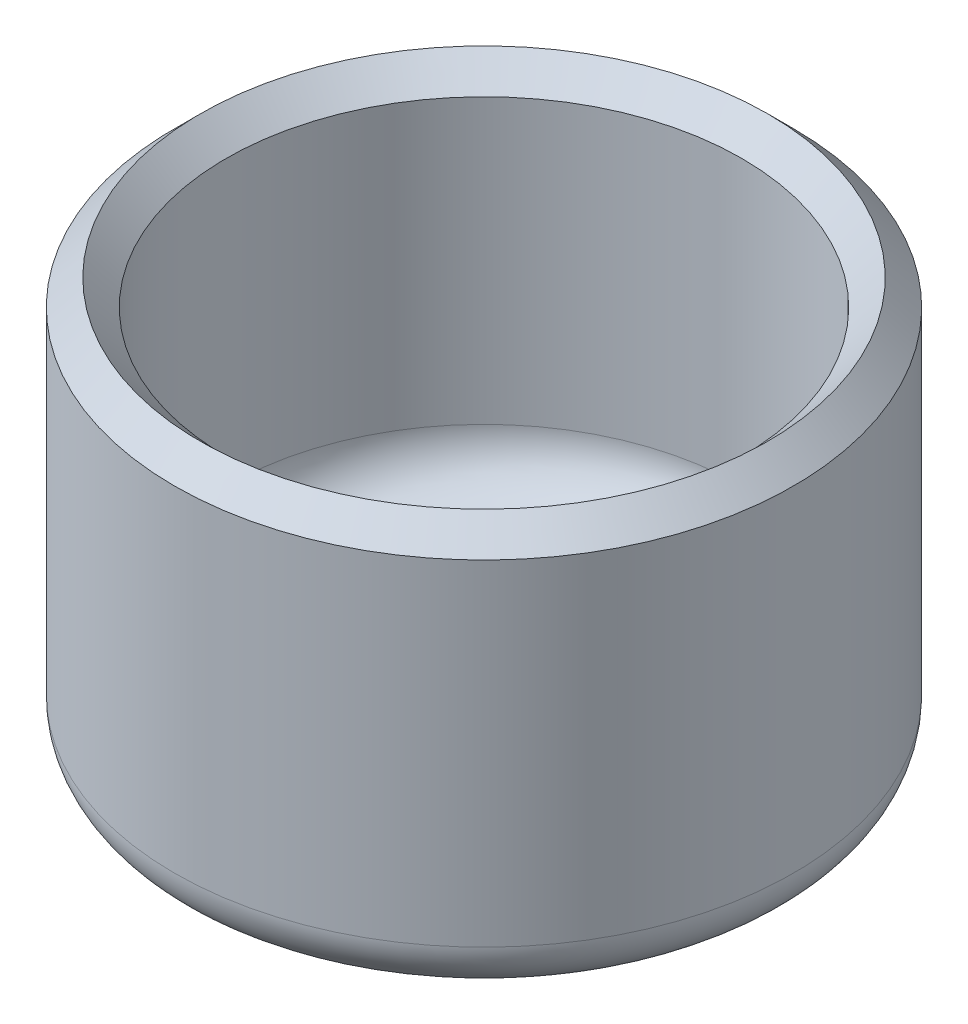
ISO-10303-21;
HEADER;
FILE_DESCRIPTION(('STEP AP214'),'2;1');
FILE_NAME('part.step','',(''),(''),'','','');
FILE_SCHEMA(('AUTOMOTIVE_DESIGN { 1 0 10303 214 1 1 1 1 }'));
ENDSEC;
DATA;
#1=APPLICATION_CONTEXT('core data for automotive mechanical design processes');
#2=APPLICATION_PROTOCOL_DEFINITION('international standard','automotive_design',2000,#1);
#3=PRODUCT_CONTEXT('',#1,'mechanical');
#4=PRODUCT('Part','Part','',(#3));
#5=PRODUCT_RELATED_PRODUCT_CATEGORY('part','',(#4));
#6=PRODUCT_DEFINITION_FORMATION('','',#4);
#7=PRODUCT_DEFINITION_CONTEXT('part definition',#1,'design');
#8=PRODUCT_DEFINITION('design','',#6,#7);
#9=PRODUCT_DEFINITION_SHAPE('','',#8);
#10=(LENGTH_UNIT() NAMED_UNIT(*) SI_UNIT(.MILLI.,.METRE.));
#11=(NAMED_UNIT(*) PLANE_ANGLE_UNIT() SI_UNIT($,.RADIAN.));
#12=(NAMED_UNIT(*) SI_UNIT($,.STERADIAN.) SOLID_ANGLE_UNIT());
#13=UNCERTAINTY_MEASURE_WITH_UNIT(LENGTH_MEASURE(1.E-05),#10,'distance_accuracy_value','');
#14=(GEOMETRIC_REPRESENTATION_CONTEXT(3) GLOBAL_UNCERTAINTY_ASSIGNED_CONTEXT((#13)) GLOBAL_UNIT_ASSIGNED_CONTEXT((#10,
#11,#12)) REPRESENTATION_CONTEXT('',''));
#15=CARTESIAN_POINT('',(0.,0.,0.));
#16=DIRECTION('',(0.,0.,1.));
#17=DIRECTION('',(1.,0.,0.));
#18=AXIS2_PLACEMENT_3D('',#15,#16,#17);
#19=CARTESIAN_POINT('',(0.,0.,0.));
#20=DIRECTION('',(0.,1.,0.));
#21=DIRECTION('',(0.,0.,1.));
#22=AXIS2_PLACEMENT_3D('',#19,#20,#21);
#23=PLANE('',#22);
#24=CARTESIAN_POINT('',(0.,0.,0.));
#25=DIRECTION('',(0.,-1.,0.));
#26=DIRECTION('',(0.,0.,-1.));
#27=AXIS2_PLACEMENT_3D('',#24,#25,#26);
#28=CIRCLE('',#27,25.);
#29=CARTESIAN_POINT('',(0.,0.,-25.));
#30=VERTEX_POINT('',#29);
#31=EDGE_CURVE('E44',#30,#30,#28,.T.);
#32=ORIENTED_EDGE('',*,*,#31,.T.);
#33=EDGE_LOOP('',(#32));
#34=FACE_BOUND('',#33,.T.);
#35=ADVANCED_FACE('F32',(#34),#23,.F.);
#36=CARTESIAN_POINT('',(0.,5.,0.));
#37=DIRECTION('',(0.,-1.,0.));
#38=DIRECTION('',(0.,0.,-1.));
#39=AXIS2_PLACEMENT_3D('',#36,#37,#38);
#40=TOROIDAL_SURFACE('',#39,25.,5.);
#41=ORIENTED_EDGE('',*,*,#31,.F.);
#42=EDGE_LOOP('',(#41));
#43=FACE_BOUND('',#42,.T.);
#44=CARTESIAN_POINT('',(0.,5.,0.));
#45=DIRECTION('',(0.,-1.,0.));
#46=DIRECTION('',(0.,0.,-1.));
#47=AXIS2_PLACEMENT_3D('',#44,#45,#46);
#48=CIRCLE('',#47,30.);
#49=CARTESIAN_POINT('',(0.,5.,-30.));
#50=VERTEX_POINT('',#49);
#51=EDGE_CURVE('E49',#50,#50,#48,.T.);
#52=ORIENTED_EDGE('',*,*,#51,.T.);
#53=EDGE_LOOP('',(#52));
#54=FACE_BOUND('',#53,.T.);
#55=ADVANCED_FACE('F76',(#43,#54),#40,.T.);
#56=CARTESIAN_POINT('',(0.,0.,0.));
#57=DIRECTION('',(0.,-1.,0.));
#58=DIRECTION('',(0.,0.,-1.));
#59=AXIS2_PLACEMENT_3D('',#56,#57,#58);
#60=CYLINDRICAL_SURFACE('',#59,30.);
#61=CARTESIAN_POINT('',(0.,37.5,0.));
#62=DIRECTION('',(0.,-1.,0.));
#63=DIRECTION('',(0.,0.,-1.));
#64=AXIS2_PLACEMENT_3D('',#61,#62,#63);
#65=CIRCLE('',#64,30.);
#66=CARTESIAN_POINT('',(0.,37.5,-30.));
#67=VERTEX_POINT('',#66);
#68=EDGE_CURVE('E10',#67,#67,#65,.T.);
#69=ORIENTED_EDGE('',*,*,#68,.T.);
#70=EDGE_LOOP('',(#69));
#71=FACE_BOUND('',#70,.T.);
#72=ORIENTED_EDGE('',*,*,#51,.F.);
#73=EDGE_LOOP('',(#72));
#74=FACE_BOUND('',#73,.T.);
#75=ADVANCED_FACE('F82',(#71,#74),#60,.T.);
#76=CARTESIAN_POINT('',(0.,0.,0.));
#77=DIRECTION('',(0.,-1.,0.));
#78=DIRECTION('',(0.,0.,-1.));
#79=AXIS2_PLACEMENT_3D('',#76,#77,#78);
#80=CYLINDRICAL_SURFACE('',#79,25.);
#81=CARTESIAN_POINT('',(0.,37.5,0.));
#82=DIRECTION('',(0.,-1.,0.));
#83=DIRECTION('',(0.,0.,-1.));
#84=AXIS2_PLACEMENT_3D('',#81,#82,#83);
#85=CIRCLE('',#84,25.);
#86=CARTESIAN_POINT('',(0.,37.5,-25.));
#87=VERTEX_POINT('',#86);
#88=EDGE_CURVE('E40',#87,#87,#85,.F.);
#89=ORIENTED_EDGE('',*,*,#88,.T.);
#90=EDGE_LOOP('',(#89));
#91=FACE_BOUND('',#90,.T.);
#92=CARTESIAN_POINT('',(0.,10.,0.));
#93=DIRECTION('',(0.,-1.,0.));
#94=DIRECTION('',(0.,0.,-1.));
#95=AXIS2_PLACEMENT_3D('',#92,#93,#94);
#96=CIRCLE('',#95,25.);
#97=CARTESIAN_POINT('',(0.,10.,-25.));
#98=VERTEX_POINT('',#97);
#99=EDGE_CURVE('E52',#98,#98,#96,.T.);
#100=ORIENTED_EDGE('',*,*,#99,.T.);
#101=EDGE_LOOP('',(#100));
#102=FACE_BOUND('',#101,.T.);
#103=ADVANCED_FACE('F88',(#91,#102),#80,.F.);
#104=CARTESIAN_POINT('',(0.,9.99999999999999,0.));
#105=DIRECTION('',(0.,-1.,0.));
#106=DIRECTION('',(0.,0.,-1.));
#107=AXIS2_PLACEMENT_3D('',#104,#105,#106);
#108=TOROIDAL_SURFACE('',#107,20.,5.);
#109=ORIENTED_EDGE('',*,*,#99,.F.);
#110=EDGE_LOOP('',(#109));
#111=FACE_BOUND('',#110,.T.);
#112=CARTESIAN_POINT('',(0.,4.99999999999999,0.));
#113=DIRECTION('',(0.,-1.,0.));
#114=DIRECTION('',(0.,0.,-1.));
#115=AXIS2_PLACEMENT_3D('',#112,#113,#114);
#116=CIRCLE('',#115,20.);
#117=CARTESIAN_POINT('',(0.,4.99999999999999,-20.));
#118=VERTEX_POINT('',#117);
#119=EDGE_CURVE('E55',#118,#118,#116,.T.);
#120=ORIENTED_EDGE('',*,*,#119,.T.);
#121=EDGE_LOOP('',(#120));
#122=FACE_BOUND('',#121,.T.);
#123=ADVANCED_FACE('F72',(#111,#122),#108,.F.);
#124=CARTESIAN_POINT('',(-20.,4.99999999999999,0.));
#125=DIRECTION('',(0.,-1.,0.));
#126=DIRECTION('',(0.,0.,-1.));
#127=AXIS2_PLACEMENT_3D('',#124,#125,#126);
#128=PLANE('',#127);
#129=ORIENTED_EDGE('',*,*,#119,.F.);
#130=EDGE_LOOP('',(#129));
#131=FACE_BOUND('',#130,.T.);
#132=ADVANCED_FACE('F65',(#131),#128,.F.);
#133=CARTESIAN_POINT('',(0.,37.5,0.));
#134=DIRECTION('',(0.,-1.,0.));
#135=DIRECTION('',(0.,0.,-1.));
#136=AXIS2_PLACEMENT_3D('',#133,#134,#135);
#137=CONICAL_SURFACE('',#136,30.,0.785398163397449);
#138=ORIENTED_EDGE('',*,*,#68,.F.);
#139=EDGE_LOOP('',(#138));
#140=FACE_BOUND('',#139,.T.);
#141=CARTESIAN_POINT('',(0.,40.,0.));
#142=DIRECTION('',(0.,-1.,0.));
#143=DIRECTION('',(0.,0.,-1.));
#144=AXIS2_PLACEMENT_3D('',#141,#142,#143);
#145=CIRCLE('',#144,27.5);
#146=CARTESIAN_POINT('',(0.,40.,-27.5));
#147=VERTEX_POINT('',#146);
#148=EDGE_CURVE('E36',#147,#147,#145,.F.);
#149=ORIENTED_EDGE('',*,*,#148,.F.);
#150=EDGE_LOOP('',(#149));
#151=FACE_BOUND('',#150,.T.);
#152=ADVANCED_FACE('F34',(#140,#151),#137,.T.);
#153=CARTESIAN_POINT('',(0.,40.,0.));
#154=DIRECTION('',(0.,1.,0.));
#155=DIRECTION('',(0.,0.,1.));
#156=AXIS2_PLACEMENT_3D('',#153,#154,#155);
#157=CONICAL_SURFACE('',#156,27.5,0.785398163397447);
#158=ORIENTED_EDGE('',*,*,#88,.F.);
#159=EDGE_LOOP('',(#158));
#160=FACE_BOUND('',#159,.T.);
#161=ORIENTED_EDGE('',*,*,#148,.T.);
#162=EDGE_LOOP('',(#161));
#163=FACE_BOUND('',#162,.T.);
#164=ADVANCED_FACE('F62',(#160,#163),#157,.F.);
#165=CLOSED_SHELL('',(#35,#55,#75,#103,#123,#132,#152,#164));
#166=MANIFOLD_SOLID_BREP('B2',#165);
#167=ADVANCED_BREP_SHAPE_REPRESENTATION('',(#18,#166),#14);
#168=SHAPE_DEFINITION_REPRESENTATION(#9,#167);
ENDSEC;
END-ISO-10303-21;
